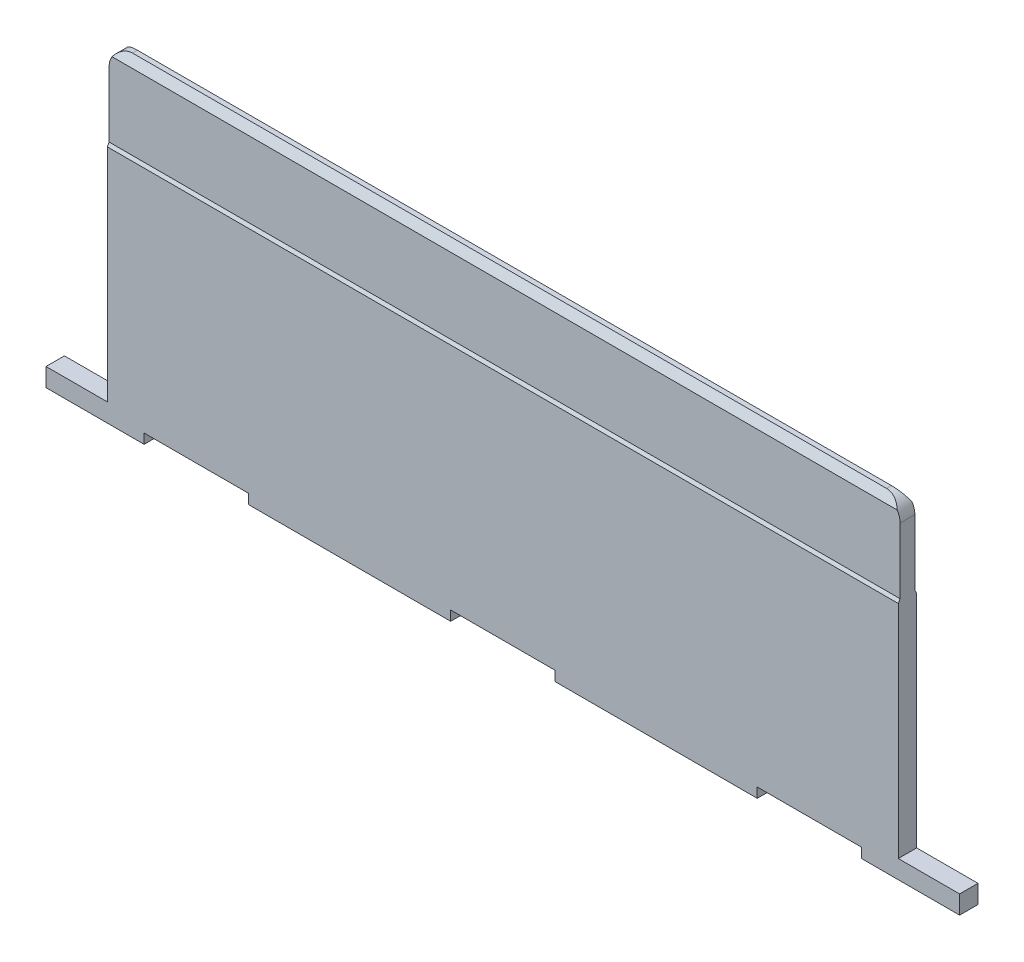
ISO-10303-21;
HEADER;
FILE_DESCRIPTION(('STEP AP214'),'2;1');
FILE_NAME('part.step','',(''),(''),'','','');
FILE_SCHEMA(('AUTOMOTIVE_DESIGN { 1 0 10303 214 1 1 1 1 }'));
ENDSEC;
DATA;
#1=APPLICATION_CONTEXT('core data for automotive mechanical design processes');
#2=APPLICATION_PROTOCOL_DEFINITION('international standard','automotive_design',2000,#1);
#3=PRODUCT_CONTEXT('',#1,'mechanical');
#4=PRODUCT('Part','Part','',(#3));
#5=PRODUCT_RELATED_PRODUCT_CATEGORY('part','',(#4));
#6=PRODUCT_DEFINITION_FORMATION('','',#4);
#7=PRODUCT_DEFINITION_CONTEXT('part definition',#1,'design');
#8=PRODUCT_DEFINITION('design','',#6,#7);
#9=PRODUCT_DEFINITION_SHAPE('','',#8);
#10=(LENGTH_UNIT() NAMED_UNIT(*) SI_UNIT(.MILLI.,.METRE.));
#11=(NAMED_UNIT(*) PLANE_ANGLE_UNIT() SI_UNIT($,.RADIAN.));
#12=(NAMED_UNIT(*) SI_UNIT($,.STERADIAN.) SOLID_ANGLE_UNIT());
#13=UNCERTAINTY_MEASURE_WITH_UNIT(LENGTH_MEASURE(1.E-05),#10,'distance_accuracy_value','');
#14=(GEOMETRIC_REPRESENTATION_CONTEXT(3) GLOBAL_UNCERTAINTY_ASSIGNED_CONTEXT((#13)) GLOBAL_UNIT_ASSIGNED_CONTEXT((#10,
#11,#12)) REPRESENTATION_CONTEXT('',''));
#15=CARTESIAN_POINT('',(0.,0.,0.));
#16=DIRECTION('',(0.,0.,1.));
#17=DIRECTION('',(1.,0.,0.));
#18=AXIS2_PLACEMENT_3D('',#15,#16,#17);
#19=CARTESIAN_POINT('',(-8.1915,0.1778,0.399999962));
#20=DIRECTION('',(0.,-1.,0.));
#21=DIRECTION('',(1.,0.,0.));
#22=AXIS2_PLACEMENT_3D('',#19,#20,#21);
#23=PLANE('',#22);
#24=DIRECTION('',(0.,0.,-1.));
#25=VECTOR('',#24,1.);
#26=CARTESIAN_POINT('',(-8.1915,0.177800000000001,0.399999962));
#27=LINE('',#26,#25);
#28=CARTESIAN_POINT('',(-8.1915,0.177800000000001,0.1905));
#29=VERTEX_POINT('',#28);
#30=CARTESIAN_POINT('',(-8.1915,0.177800000000001,-0.1905));
#31=VERTEX_POINT('',#30);
#32=EDGE_CURVE('E11',#29,#31,#27,.T.);
#33=ORIENTED_EDGE('',*,*,#32,.T.);
#34=DIRECTION('',(-1.,0.,0.));
#35=VECTOR('',#34,1.);
#36=CARTESIAN_POINT('',(-8.1915,0.1778,-0.1905));
#37=LINE('',#36,#35);
#38=CARTESIAN_POINT('',(-9.4615,0.1778,-0.1905));
#39=VERTEX_POINT('',#38);
#40=EDGE_CURVE('E24',#31,#39,#37,.T.);
#41=ORIENTED_EDGE('',*,*,#40,.T.);
#42=DIRECTION('',(0.,0.,-1.));
#43=VECTOR('',#42,1.);
#44=CARTESIAN_POINT('',(-9.4615,0.1778,0.399999962));
#45=LINE('',#44,#43);
#46=CARTESIAN_POINT('',(-9.4615,0.1778,0.1905));
#47=VERTEX_POINT('',#46);
#48=EDGE_CURVE('E418',#47,#39,#45,.T.);
#49=ORIENTED_EDGE('',*,*,#48,.F.);
#50=DIRECTION('',(1.,0.,0.));
#51=VECTOR('',#50,1.);
#52=CARTESIAN_POINT('',(-8.1915,0.1778,0.1905));
#53=LINE('',#52,#51);
#54=EDGE_CURVE('E416',#47,#29,#53,.T.);
#55=ORIENTED_EDGE('',*,*,#54,.T.);
#56=EDGE_LOOP('',(#33,#41,#49,#55));
#57=FACE_BOUND('',#56,.T.);
#58=ADVANCED_FACE('F17',(#57),#23,.F.);
#59=CARTESIAN_POINT('',(-9.4615,0.1778,0.399999962));
#60=DIRECTION('',(1.,0.,0.));
#61=DIRECTION('',(0.,0.,-1.));
#62=AXIS2_PLACEMENT_3D('',#59,#60,#61);
#63=PLANE('',#62);
#64=ORIENTED_EDGE('',*,*,#48,.T.);
#65=DIRECTION('',(0.,-1.,0.));
#66=VECTOR('',#65,1.);
#67=CARTESIAN_POINT('',(-9.4615,0.1778,-0.1905));
#68=LINE('',#67,#66);
#69=CARTESIAN_POINT('',(-9.4615,-0.2032,-0.1905));
#70=VERTEX_POINT('',#69);
#71=EDGE_CURVE('E414',#39,#70,#68,.T.);
#72=ORIENTED_EDGE('',*,*,#71,.T.);
#73=DIRECTION('',(0.,0.,-1.));
#74=VECTOR('',#73,1.);
#75=CARTESIAN_POINT('',(-9.4615,-0.2032,0.399999962));
#76=LINE('',#75,#74);
#77=CARTESIAN_POINT('',(-9.4615,-0.2032,0.1905));
#78=VERTEX_POINT('',#77);
#79=EDGE_CURVE('E411',#78,#70,#76,.T.);
#80=ORIENTED_EDGE('',*,*,#79,.F.);
#81=DIRECTION('',(0.,1.,0.));
#82=VECTOR('',#81,1.);
#83=CARTESIAN_POINT('',(-9.4615,0.1778,0.1905));
#84=LINE('',#83,#82);
#85=EDGE_CURVE('E408',#78,#47,#84,.T.);
#86=ORIENTED_EDGE('',*,*,#85,.T.);
#87=EDGE_LOOP('',(#64,#72,#80,#86));
#88=FACE_BOUND('',#87,.T.);
#89=ADVANCED_FACE('F425',(#88),#63,.F.);
#90=CARTESIAN_POINT('',(-9.4615,-0.2032,0.399999962));
#91=DIRECTION('',(0.,1.,0.));
#92=DIRECTION('',(0.,0.,1.));
#93=AXIS2_PLACEMENT_3D('',#90,#91,#92);
#94=PLANE('',#93);
#95=ORIENTED_EDGE('',*,*,#79,.T.);
#96=DIRECTION('',(-1.,0.,0.));
#97=VECTOR('',#96,1.);
#98=CARTESIAN_POINT('',(10.00000032,-0.2032,-0.1905));
#99=LINE('',#98,#97);
#100=CARTESIAN_POINT('',(-7.429000128,-0.2032,-0.1905));
#101=VERTEX_POINT('',#100);
#102=EDGE_CURVE('E405',#101,#70,#99,.T.);
#103=ORIENTED_EDGE('',*,*,#102,.F.);
#104=DIRECTION('',(0.,0.,-1.));
#105=VECTOR('',#104,1.);
#106=CARTESIAN_POINT('',(-7.429000128,-0.2032,0.399999962));
#107=LINE('',#106,#105);
#108=CARTESIAN_POINT('',(-7.429000128,-0.2032,0.1905));
#109=VERTEX_POINT('',#108);
#110=EDGE_CURVE('E402',#109,#101,#107,.T.);
#111=ORIENTED_EDGE('',*,*,#110,.F.);
#112=DIRECTION('',(-1.,0.,0.));
#113=VECTOR('',#112,1.);
#114=CARTESIAN_POINT('',(10.00000032,-0.2032,0.1905));
#115=LINE('',#114,#113);
#116=EDGE_CURVE('E399',#109,#78,#115,.T.);
#117=ORIENTED_EDGE('',*,*,#116,.T.);
#118=EDGE_LOOP('',(#95,#103,#111,#117));
#119=FACE_BOUND('',#118,.T.);
#120=ADVANCED_FACE('F431',(#119),#94,.F.);
#121=CARTESIAN_POINT('',(-7.429000128,-0.2032,0.399999962));
#122=DIRECTION('',(-1.,0.,0.));
#123=DIRECTION('',(0.,0.,1.));
#124=AXIS2_PLACEMENT_3D('',#121,#122,#123);
#125=PLANE('',#124);
#126=ORIENTED_EDGE('',*,*,#110,.T.);
#127=DIRECTION('',(0.,1.,0.));
#128=VECTOR('',#127,1.);
#129=CARTESIAN_POINT('',(-7.429000128,-0.2032,-0.1905));
#130=LINE('',#129,#128);
#131=CARTESIAN_POINT('',(-7.429000128,0.,-0.1905));
#132=VERTEX_POINT('',#131);
#133=EDGE_CURVE('E397',#101,#132,#130,.T.);
#134=ORIENTED_EDGE('',*,*,#133,.T.);
#135=DIRECTION('',(0.,0.,-1.));
#136=VECTOR('',#135,1.);
#137=CARTESIAN_POINT('',(-7.429000128,0.,0.399999962));
#138=LINE('',#137,#136);
#139=CARTESIAN_POINT('',(-7.429000128,0.,0.1905));
#140=VERTEX_POINT('',#139);
#141=EDGE_CURVE('E394',#140,#132,#138,.T.);
#142=ORIENTED_EDGE('',*,*,#141,.F.);
#143=DIRECTION('',(0.,-1.,0.));
#144=VECTOR('',#143,1.);
#145=CARTESIAN_POINT('',(-7.429000128,-0.2032,0.1905));
#146=LINE('',#145,#144);
#147=EDGE_CURVE('E391',#140,#109,#146,.T.);
#148=ORIENTED_EDGE('',*,*,#147,.T.);
#149=EDGE_LOOP('',(#126,#134,#142,#148));
#150=FACE_BOUND('',#149,.T.);
#151=ADVANCED_FACE('F434',(#150),#125,.F.);
#152=CARTESIAN_POINT('',(-7.429000128,0.,0.399999962));
#153=DIRECTION('',(0.,1.,0.));
#154=DIRECTION('',(0.,0.,1.));
#155=AXIS2_PLACEMENT_3D('',#152,#153,#154);
#156=PLANE('',#155);
#157=ORIENTED_EDGE('',*,*,#141,.T.);
#158=DIRECTION('',(1.,0.,0.));
#159=VECTOR('',#158,1.);
#160=CARTESIAN_POINT('',(-7.429000128,0.,-0.1905));
#161=LINE('',#160,#159);
#162=CARTESIAN_POINT('',(-5.271000126,0.,-0.1905));
#163=VERTEX_POINT('',#162);
#164=EDGE_CURVE('E389',#132,#163,#161,.T.);
#165=ORIENTED_EDGE('',*,*,#164,.T.);
#166=DIRECTION('',(0.,0.,-1.));
#167=VECTOR('',#166,1.);
#168=CARTESIAN_POINT('',(-5.271000126,0.,0.399999962));
#169=LINE('',#168,#167);
#170=CARTESIAN_POINT('',(-5.271000126,0.,0.1905));
#171=VERTEX_POINT('',#170);
#172=EDGE_CURVE('E386',#171,#163,#169,.T.);
#173=ORIENTED_EDGE('',*,*,#172,.F.);
#174=DIRECTION('',(-1.,0.,0.));
#175=VECTOR('',#174,1.);
#176=CARTESIAN_POINT('',(-7.429000128,0.,0.1905));
#177=LINE('',#176,#175);
#178=EDGE_CURVE('E383',#171,#140,#177,.T.);
#179=ORIENTED_EDGE('',*,*,#178,.T.);
#180=EDGE_LOOP('',(#157,#165,#173,#179));
#181=FACE_BOUND('',#180,.T.);
#182=ADVANCED_FACE('F441',(#181),#156,.F.);
#183=CARTESIAN_POINT('',(-5.271000126,0.,0.399999962));
#184=DIRECTION('',(1.,0.,0.));
#185=DIRECTION('',(0.,0.,-1.));
#186=AXIS2_PLACEMENT_3D('',#183,#184,#185);
#187=PLANE('',#186);
#188=ORIENTED_EDGE('',*,*,#172,.T.);
#189=DIRECTION('',(0.,-1.,0.));
#190=VECTOR('',#189,1.);
#191=CARTESIAN_POINT('',(-5.271000126,0.,-0.1905));
#192=LINE('',#191,#190);
#193=CARTESIAN_POINT('',(-5.271000126,-0.203000102,-0.1905));
#194=VERTEX_POINT('',#193);
#195=EDGE_CURVE('E381',#163,#194,#192,.T.);
#196=ORIENTED_EDGE('',*,*,#195,.T.);
#197=DIRECTION('',(0.,0.,-1.));
#198=VECTOR('',#197,1.);
#199=CARTESIAN_POINT('',(-5.271000126,-0.203000102,0.399999962));
#200=LINE('',#199,#198);
#201=CARTESIAN_POINT('',(-5.271000126,-0.203000102,0.1905));
#202=VERTEX_POINT('',#201);
#203=EDGE_CURVE('E378',#202,#194,#200,.T.);
#204=ORIENTED_EDGE('',*,*,#203,.F.);
#205=DIRECTION('',(0.,1.,0.));
#206=VECTOR('',#205,1.);
#207=CARTESIAN_POINT('',(-5.271000126,0.,0.1905));
#208=LINE('',#207,#206);
#209=EDGE_CURVE('E375',#202,#171,#208,.T.);
#210=ORIENTED_EDGE('',*,*,#209,.T.);
#211=EDGE_LOOP('',(#188,#196,#204,#210));
#212=FACE_BOUND('',#211,.T.);
#213=ADVANCED_FACE('F444',(#212),#187,.F.);
#214=CARTESIAN_POINT('',(-5.271000126,-0.203000102,0.399999962));
#215=DIRECTION('',(0.,1.,0.));
#216=DIRECTION('',(0.,0.,1.));
#217=AXIS2_PLACEMENT_3D('',#214,#215,#216);
#218=PLANE('',#217);
#219=ORIENTED_EDGE('',*,*,#203,.T.);
#220=DIRECTION('',(1.,0.,0.));
#221=VECTOR('',#220,1.);
#222=CARTESIAN_POINT('',(-5.271000126,-0.203000102,-0.1905));
#223=LINE('',#222,#221);
#224=CARTESIAN_POINT('',(-1.080000126,-0.203000102,-0.1905));
#225=VERTEX_POINT('',#224);
#226=EDGE_CURVE('E373',#194,#225,#223,.T.);
#227=ORIENTED_EDGE('',*,*,#226,.T.);
#228=DIRECTION('',(0.,0.,-1.));
#229=VECTOR('',#228,1.);
#230=CARTESIAN_POINT('',(-1.080000126,-0.203000102,0.399999962));
#231=LINE('',#230,#229);
#232=CARTESIAN_POINT('',(-1.080000126,-0.203000102,0.1905));
#233=VERTEX_POINT('',#232);
#234=EDGE_CURVE('E370',#233,#225,#231,.T.);
#235=ORIENTED_EDGE('',*,*,#234,.F.);
#236=DIRECTION('',(-1.,0.,0.));
#237=VECTOR('',#236,1.);
#238=CARTESIAN_POINT('',(-5.271000126,-0.203000102,0.1905));
#239=LINE('',#238,#237);
#240=EDGE_CURVE('E367',#233,#202,#239,.T.);
#241=ORIENTED_EDGE('',*,*,#240,.T.);
#242=EDGE_LOOP('',(#219,#227,#235,#241));
#243=FACE_BOUND('',#242,.T.);
#244=ADVANCED_FACE('F449',(#243),#218,.F.);
#245=CARTESIAN_POINT('',(-1.080000126,-0.203000102,0.399999962));
#246=DIRECTION('',(-1.,0.,0.));
#247=DIRECTION('',(0.,0.,1.));
#248=AXIS2_PLACEMENT_3D('',#245,#246,#247);
#249=PLANE('',#248);
#250=ORIENTED_EDGE('',*,*,#234,.T.);
#251=DIRECTION('',(0.,1.,0.));
#252=VECTOR('',#251,1.);
#253=CARTESIAN_POINT('',(-1.080000126,-0.203000102,-0.1905));
#254=LINE('',#253,#252);
#255=CARTESIAN_POINT('',(-1.080000126,0.,-0.1905));
#256=VERTEX_POINT('',#255);
#257=EDGE_CURVE('E365',#225,#256,#254,.T.);
#258=ORIENTED_EDGE('',*,*,#257,.T.);
#259=DIRECTION('',(0.,0.,-1.));
#260=VECTOR('',#259,1.);
#261=CARTESIAN_POINT('',(-1.080000126,0.,0.399999962));
#262=LINE('',#261,#260);
#263=CARTESIAN_POINT('',(-1.080000126,0.,0.1905));
#264=VERTEX_POINT('',#263);
#265=EDGE_CURVE('E362',#264,#256,#262,.T.);
#266=ORIENTED_EDGE('',*,*,#265,.F.);
#267=DIRECTION('',(0.,-1.,0.));
#268=VECTOR('',#267,1.);
#269=CARTESIAN_POINT('',(-1.080000126,-0.203000102,0.1905));
#270=LINE('',#269,#268);
#271=EDGE_CURVE('E359',#264,#233,#270,.T.);
#272=ORIENTED_EDGE('',*,*,#271,.T.);
#273=EDGE_LOOP('',(#250,#258,#266,#272));
#274=FACE_BOUND('',#273,.T.);
#275=ADVANCED_FACE('F452',(#274),#249,.F.);
#276=CARTESIAN_POINT('',(-1.080000126,0.,0.399999962));
#277=DIRECTION('',(0.,1.,0.));
#278=DIRECTION('',(0.,0.,1.));
#279=AXIS2_PLACEMENT_3D('',#276,#277,#278);
#280=PLANE('',#279);
#281=ORIENTED_EDGE('',*,*,#265,.T.);
#282=DIRECTION('',(1.,0.,0.));
#283=VECTOR('',#282,1.);
#284=CARTESIAN_POINT('',(-1.080000126,0.,-0.1905));
#285=LINE('',#284,#283);
#286=CARTESIAN_POINT('',(1.080000126,0.,-0.1905));
#287=VERTEX_POINT('',#286);
#288=EDGE_CURVE('E357',#256,#287,#285,.T.);
#289=ORIENTED_EDGE('',*,*,#288,.T.);
#290=DIRECTION('',(0.,0.,-1.));
#291=VECTOR('',#290,1.);
#292=CARTESIAN_POINT('',(1.080000126,0.,0.399999962));
#293=LINE('',#292,#291);
#294=CARTESIAN_POINT('',(1.080000126,0.,0.1905));
#295=VERTEX_POINT('',#294);
#296=EDGE_CURVE('E354',#295,#287,#293,.T.);
#297=ORIENTED_EDGE('',*,*,#296,.F.);
#298=DIRECTION('',(-1.,0.,0.));
#299=VECTOR('',#298,1.);
#300=CARTESIAN_POINT('',(-1.080000126,0.,0.1905));
#301=LINE('',#300,#299);
#302=EDGE_CURVE('E351',#295,#264,#301,.T.);
#303=ORIENTED_EDGE('',*,*,#302,.T.);
#304=EDGE_LOOP('',(#281,#289,#297,#303));
#305=FACE_BOUND('',#304,.T.);
#306=ADVANCED_FACE('F457',(#305),#280,.F.);
#307=CARTESIAN_POINT('',(1.080000126,0.,0.399999962));
#308=DIRECTION('',(1.,0.,0.));
#309=DIRECTION('',(0.,0.,-1.));
#310=AXIS2_PLACEMENT_3D('',#307,#308,#309);
#311=PLANE('',#310);
#312=ORIENTED_EDGE('',*,*,#296,.T.);
#313=DIRECTION('',(0.,-1.,0.));
#314=VECTOR('',#313,1.);
#315=CARTESIAN_POINT('',(1.080000126,0.,-0.1905));
#316=LINE('',#315,#314);
#317=CARTESIAN_POINT('',(1.080000126,-0.2032,-0.1905));
#318=VERTEX_POINT('',#317);
#319=EDGE_CURVE('E349',#287,#318,#316,.T.);
#320=ORIENTED_EDGE('',*,*,#319,.T.);
#321=DIRECTION('',(0.,0.,-1.));
#322=VECTOR('',#321,1.);
#323=CARTESIAN_POINT('',(1.080000126,-0.2032,0.399999962));
#324=LINE('',#323,#322);
#325=CARTESIAN_POINT('',(1.080000126,-0.2032,0.1905));
#326=VERTEX_POINT('',#325);
#327=EDGE_CURVE('E346',#326,#318,#324,.T.);
#328=ORIENTED_EDGE('',*,*,#327,.F.);
#329=DIRECTION('',(0.,1.,0.));
#330=VECTOR('',#329,1.);
#331=CARTESIAN_POINT('',(1.080000126,0.,0.1905));
#332=LINE('',#331,#330);
#333=EDGE_CURVE('E343',#326,#295,#332,.T.);
#334=ORIENTED_EDGE('',*,*,#333,.T.);
#335=EDGE_LOOP('',(#312,#320,#328,#334));
#336=FACE_BOUND('',#335,.T.);
#337=ADVANCED_FACE('F460',(#336),#311,.F.);
#338=CARTESIAN_POINT('',(1.080000126,-0.2032,0.399999962));
#339=DIRECTION('',(0.,1.,0.));
#340=DIRECTION('',(0.,0.,1.));
#341=AXIS2_PLACEMENT_3D('',#338,#339,#340);
#342=PLANE('',#341);
#343=ORIENTED_EDGE('',*,*,#327,.T.);
#344=DIRECTION('',(-1.,0.,0.));
#345=VECTOR('',#344,1.);
#346=CARTESIAN_POINT('',(10.00000032,-0.2032,-0.1905));
#347=LINE('',#346,#345);
#348=CARTESIAN_POINT('',(5.270000128,-0.2032,-0.1905));
#349=VERTEX_POINT('',#348);
#350=EDGE_CURVE('E340',#349,#318,#347,.T.);
#351=ORIENTED_EDGE('',*,*,#350,.F.);
#352=DIRECTION('',(0.,0.,-1.));
#353=VECTOR('',#352,1.);
#354=CARTESIAN_POINT('',(5.270000128,-0.2032,0.399999962));
#355=LINE('',#354,#353);
#356=CARTESIAN_POINT('',(5.270000128,-0.2032,0.1905));
#357=VERTEX_POINT('',#356);
#358=EDGE_CURVE('E337',#357,#349,#355,.T.);
#359=ORIENTED_EDGE('',*,*,#358,.F.);
#360=DIRECTION('',(-1.,0.,0.));
#361=VECTOR('',#360,1.);
#362=CARTESIAN_POINT('',(10.00000032,-0.2032,0.1905));
#363=LINE('',#362,#361);
#364=EDGE_CURVE('E334',#357,#326,#363,.T.);
#365=ORIENTED_EDGE('',*,*,#364,.T.);
#366=EDGE_LOOP('',(#343,#351,#359,#365));
#367=FACE_BOUND('',#366,.T.);
#368=ADVANCED_FACE('F464',(#367),#342,.F.);
#369=CARTESIAN_POINT('',(5.270000128,-0.2032,0.399999962));
#370=DIRECTION('',(-1.,0.,0.));
#371=DIRECTION('',(0.,0.,1.));
#372=AXIS2_PLACEMENT_3D('',#369,#370,#371);
#373=PLANE('',#372);
#374=ORIENTED_EDGE('',*,*,#358,.T.);
#375=DIRECTION('',(0.,1.,0.));
#376=VECTOR('',#375,1.);
#377=CARTESIAN_POINT('',(5.270000128,-0.2032,-0.1905));
#378=LINE('',#377,#376);
#379=CARTESIAN_POINT('',(5.270000128,0.,-0.1905));
#380=VERTEX_POINT('',#379);
#381=EDGE_CURVE('E332',#349,#380,#378,.T.);
#382=ORIENTED_EDGE('',*,*,#381,.T.);
#383=DIRECTION('',(0.,0.,-1.));
#384=VECTOR('',#383,1.);
#385=CARTESIAN_POINT('',(5.270000128,0.,0.399999962));
#386=LINE('',#385,#384);
#387=CARTESIAN_POINT('',(5.270000128,0.,0.1905));
#388=VERTEX_POINT('',#387);
#389=EDGE_CURVE('E329',#388,#380,#386,.T.);
#390=ORIENTED_EDGE('',*,*,#389,.F.);
#391=DIRECTION('',(0.,-1.,0.));
#392=VECTOR('',#391,1.);
#393=CARTESIAN_POINT('',(5.270000128,-0.2032,0.1905));
#394=LINE('',#393,#392);
#395=EDGE_CURVE('E326',#388,#357,#394,.T.);
#396=ORIENTED_EDGE('',*,*,#395,.T.);
#397=EDGE_LOOP('',(#374,#382,#390,#396));
#398=FACE_BOUND('',#397,.T.);
#399=ADVANCED_FACE('F467',(#398),#373,.F.);
#400=CARTESIAN_POINT('',(5.270000128,0.,0.399999962));
#401=DIRECTION('',(0.,1.,0.));
#402=DIRECTION('',(0.,0.,1.));
#403=AXIS2_PLACEMENT_3D('',#400,#401,#402);
#404=PLANE('',#403);
#405=ORIENTED_EDGE('',*,*,#389,.T.);
#406=DIRECTION('',(1.,0.,0.));
#407=VECTOR('',#406,1.);
#408=CARTESIAN_POINT('',(5.270000128,0.,-0.1905));
#409=LINE('',#408,#407);
#410=CARTESIAN_POINT('',(7.429000128,0.,-0.1905));
#411=VERTEX_POINT('',#410);
#412=EDGE_CURVE('E324',#380,#411,#409,.T.);
#413=ORIENTED_EDGE('',*,*,#412,.T.);
#414=DIRECTION('',(0.,0.,-1.));
#415=VECTOR('',#414,1.);
#416=CARTESIAN_POINT('',(7.429000128,0.,0.399999962));
#417=LINE('',#416,#415);
#418=CARTESIAN_POINT('',(7.429000128,0.,0.1905));
#419=VERTEX_POINT('',#418);
#420=EDGE_CURVE('E321',#419,#411,#417,.T.);
#421=ORIENTED_EDGE('',*,*,#420,.F.);
#422=DIRECTION('',(-1.,0.,0.));
#423=VECTOR('',#422,1.);
#424=CARTESIAN_POINT('',(5.270000128,0.,0.1905));
#425=LINE('',#424,#423);
#426=EDGE_CURVE('E318',#419,#388,#425,.T.);
#427=ORIENTED_EDGE('',*,*,#426,.T.);
#428=EDGE_LOOP('',(#405,#413,#421,#427));
#429=FACE_BOUND('',#428,.T.);
#430=ADVANCED_FACE('F472',(#429),#404,.F.);
#431=CARTESIAN_POINT('',(7.429000128,0.,0.399999962));
#432=DIRECTION('',(1.,0.,0.));
#433=DIRECTION('',(0.,0.,-1.));
#434=AXIS2_PLACEMENT_3D('',#431,#432,#433);
#435=PLANE('',#434);
#436=ORIENTED_EDGE('',*,*,#420,.T.);
#437=DIRECTION('',(0.,-1.,0.));
#438=VECTOR('',#437,1.);
#439=CARTESIAN_POINT('',(7.429000128,0.,-0.1905));
#440=LINE('',#439,#438);
#441=CARTESIAN_POINT('',(7.429000128,-0.2032,-0.1905));
#442=VERTEX_POINT('',#441);
#443=EDGE_CURVE('E316',#411,#442,#440,.T.);
#444=ORIENTED_EDGE('',*,*,#443,.T.);
#445=DIRECTION('',(0.,0.,-1.));
#446=VECTOR('',#445,1.);
#447=CARTESIAN_POINT('',(7.429000128,-0.2032,0.399999962));
#448=LINE('',#447,#446);
#449=CARTESIAN_POINT('',(7.429000128,-0.2032,0.1905));
#450=VERTEX_POINT('',#449);
#451=EDGE_CURVE('E313',#450,#442,#448,.T.);
#452=ORIENTED_EDGE('',*,*,#451,.F.);
#453=DIRECTION('',(0.,1.,0.));
#454=VECTOR('',#453,1.);
#455=CARTESIAN_POINT('',(7.429000128,0.,0.1905));
#456=LINE('',#455,#454);
#457=EDGE_CURVE('E310',#450,#419,#456,.T.);
#458=ORIENTED_EDGE('',*,*,#457,.T.);
#459=EDGE_LOOP('',(#436,#444,#452,#458));
#460=FACE_BOUND('',#459,.T.);
#461=ADVANCED_FACE('F475',(#460),#435,.F.);
#462=CARTESIAN_POINT('',(7.429000128,-0.2032,0.399999962));
#463=DIRECTION('',(0.,1.,0.));
#464=DIRECTION('',(0.,0.,1.));
#465=AXIS2_PLACEMENT_3D('',#462,#463,#464);
#466=PLANE('',#465);
#467=ORIENTED_EDGE('',*,*,#451,.T.);
#468=DIRECTION('',(-1.,0.,0.));
#469=VECTOR('',#468,1.);
#470=CARTESIAN_POINT('',(10.00000032,-0.2032,-0.1905));
#471=LINE('',#470,#469);
#472=CARTESIAN_POINT('',(9.4615,-0.2032,-0.1905));
#473=VERTEX_POINT('',#472);
#474=EDGE_CURVE('E307',#473,#442,#471,.T.);
#475=ORIENTED_EDGE('',*,*,#474,.F.);
#476=DIRECTION('',(0.,0.,-1.));
#477=VECTOR('',#476,1.);
#478=CARTESIAN_POINT('',(9.4615,-0.2032,0.399999962));
#479=LINE('',#478,#477);
#480=CARTESIAN_POINT('',(9.4615,-0.2032,0.1905));
#481=VERTEX_POINT('',#480);
#482=EDGE_CURVE('E304',#481,#473,#479,.T.);
#483=ORIENTED_EDGE('',*,*,#482,.F.);
#484=DIRECTION('',(-1.,0.,0.));
#485=VECTOR('',#484,1.);
#486=CARTESIAN_POINT('',(10.00000032,-0.2032,0.1905));
#487=LINE('',#486,#485);
#488=EDGE_CURVE('E301',#481,#450,#487,.T.);
#489=ORIENTED_EDGE('',*,*,#488,.T.);
#490=EDGE_LOOP('',(#467,#475,#483,#489));
#491=FACE_BOUND('',#490,.T.);
#492=ADVANCED_FACE('F479',(#491),#466,.F.);
#493=CARTESIAN_POINT('',(9.4615,-0.2032,0.399999962));
#494=DIRECTION('',(-1.,0.,0.));
#495=DIRECTION('',(0.,0.,1.));
#496=AXIS2_PLACEMENT_3D('',#493,#494,#495);
#497=PLANE('',#496);
#498=ORIENTED_EDGE('',*,*,#482,.T.);
#499=DIRECTION('',(0.,1.,0.));
#500=VECTOR('',#499,1.);
#501=CARTESIAN_POINT('',(9.4615,-0.2032,-0.1905));
#502=LINE('',#501,#500);
#503=CARTESIAN_POINT('',(9.4615,0.1778,-0.1905));
#504=VERTEX_POINT('',#503);
#505=EDGE_CURVE('E299',#473,#504,#502,.T.);
#506=ORIENTED_EDGE('',*,*,#505,.T.);
#507=DIRECTION('',(0.,0.,-1.));
#508=VECTOR('',#507,1.);
#509=CARTESIAN_POINT('',(9.4615,0.1778,0.399999962));
#510=LINE('',#509,#508);
#511=CARTESIAN_POINT('',(9.4615,0.1778,0.1905));
#512=VERTEX_POINT('',#511);
#513=EDGE_CURVE('E296',#512,#504,#510,.T.);
#514=ORIENTED_EDGE('',*,*,#513,.F.);
#515=DIRECTION('',(0.,-1.,0.));
#516=VECTOR('',#515,1.);
#517=CARTESIAN_POINT('',(9.4615,-0.2032,0.1905));
#518=LINE('',#517,#516);
#519=EDGE_CURVE('E293',#512,#481,#518,.T.);
#520=ORIENTED_EDGE('',*,*,#519,.T.);
#521=EDGE_LOOP('',(#498,#506,#514,#520));
#522=FACE_BOUND('',#521,.T.);
#523=ADVANCED_FACE('F482',(#522),#497,.F.);
#524=CARTESIAN_POINT('',(9.4615,0.1778,0.399999962));
#525=DIRECTION('',(0.,-1.,0.));
#526=DIRECTION('',(1.,0.,0.));
#527=AXIS2_PLACEMENT_3D('',#524,#525,#526);
#528=PLANE('',#527);
#529=ORIENTED_EDGE('',*,*,#513,.T.);
#530=DIRECTION('',(-1.,0.,0.));
#531=VECTOR('',#530,1.);
#532=CARTESIAN_POINT('',(9.4615,0.1778,-0.1905));
#533=LINE('',#532,#531);
#534=CARTESIAN_POINT('',(8.1915,0.1778,-0.1905));
#535=VERTEX_POINT('',#534);
#536=EDGE_CURVE('E291',#504,#535,#533,.T.);
#537=ORIENTED_EDGE('',*,*,#536,.T.);
#538=DIRECTION('',(0.,0.,-1.));
#539=VECTOR('',#538,1.);
#540=CARTESIAN_POINT('',(8.1915,0.1778,0.399999962));
#541=LINE('',#540,#539);
#542=CARTESIAN_POINT('',(8.1915,0.1778,0.1905));
#543=VERTEX_POINT('',#542);
#544=EDGE_CURVE('E288',#543,#535,#541,.T.);
#545=ORIENTED_EDGE('',*,*,#544,.F.);
#546=DIRECTION('',(1.,0.,0.));
#547=VECTOR('',#546,1.);
#548=CARTESIAN_POINT('',(9.4615,0.1778,0.1905));
#549=LINE('',#548,#547);
#550=EDGE_CURVE('E285',#543,#512,#549,.T.);
#551=ORIENTED_EDGE('',*,*,#550,.T.);
#552=EDGE_LOOP('',(#529,#537,#545,#551));
#553=FACE_BOUND('',#552,.T.);
#554=ADVANCED_FACE('F487',(#553),#528,.F.);
#555=CARTESIAN_POINT('',(8.1915,0.1778,0.399999962));
#556=DIRECTION('',(-1.,0.,0.));
#557=DIRECTION('',(0.,0.,1.));
#558=AXIS2_PLACEMENT_3D('',#555,#556,#557);
#559=PLANE('',#558);
#560=DIRECTION('',(0.,0.866025403784439,0.499999999999999));
#561=VECTOR('',#560,1.);
#562=CARTESIAN_POINT('',(8.1915,1.5771289840129,-2.023708934814));
#563=LINE('',#562,#561);
#564=CARTESIAN_POINT('',(8.1915,4.75234,-0.1905));
#565=VERTEX_POINT('',#564);
#566=CARTESIAN_POINT('',(8.1915,4.8183311357684,-0.1524));
#567=VERTEX_POINT('',#566);
#568=EDGE_CURVE('E283',#565,#567,#563,.T.);
#569=ORIENTED_EDGE('',*,*,#568,.T.);
#570=DIRECTION('',(0.,1.,0.));
#571=VECTOR('',#570,1.);
#572=CARTESIAN_POINT('',(8.1915,0.1778,-0.1524));
#573=LINE('',#572,#571);
#574=CARTESIAN_POINT('',(8.1915,6.17474,-0.1524));
#575=VERTEX_POINT('',#574);
#576=EDGE_CURVE('E281',#567,#575,#573,.T.);
#577=ORIENTED_EDGE('',*,*,#576,.T.);
#578=DIRECTION('',(0.,0.,-1.));
#579=VECTOR('',#578,1.);
#580=CARTESIAN_POINT('',(8.1915,6.17474,0.399999962));
#581=LINE('',#580,#579);
#582=CARTESIAN_POINT('',(8.1915,6.17474,0.1524));
#583=VERTEX_POINT('',#582);
#584=EDGE_CURVE('E278',#583,#575,#581,.T.);
#585=ORIENTED_EDGE('',*,*,#584,.F.);
#586=DIRECTION('',(0.,-1.,0.));
#587=VECTOR('',#586,1.);
#588=CARTESIAN_POINT('',(8.1915,0.1778,0.1524));
#589=LINE('',#588,#587);
#590=CARTESIAN_POINT('',(8.1915,4.8183311357684,0.1524));
#591=VERTEX_POINT('',#590);
#592=EDGE_CURVE('E276',#583,#591,#589,.T.);
#593=ORIENTED_EDGE('',*,*,#592,.T.);
#594=DIRECTION('',(0.,-0.866025403784439,0.499999999999999));
#595=VECTOR('',#594,1.);
#596=CARTESIAN_POINT('',(8.1915,1.2307188554081,2.223708915814));
#597=LINE('',#596,#595);
#598=CARTESIAN_POINT('',(8.1915,4.75234,0.1905));
#599=VERTEX_POINT('',#598);
#600=EDGE_CURVE('E220',#591,#599,#597,.T.);
#601=ORIENTED_EDGE('',*,*,#600,.T.);
#602=DIRECTION('',(0.,-1.,0.));
#603=VECTOR('',#602,1.);
#604=CARTESIAN_POINT('',(8.1915,0.1778,0.1905));
#605=LINE('',#604,#603);
#606=EDGE_CURVE('E272',#599,#543,#605,.T.);
#607=ORIENTED_EDGE('',*,*,#606,.T.);
#608=ORIENTED_EDGE('',*,*,#544,.T.);
#609=DIRECTION('',(0.,1.,0.));
#610=VECTOR('',#609,1.);
#611=CARTESIAN_POINT('',(8.1915,0.1778,-0.1905));
#612=LINE('',#611,#610);
#613=EDGE_CURVE('E269',#535,#565,#612,.T.);
#614=ORIENTED_EDGE('',*,*,#613,.T.);
#615=EDGE_LOOP('',(#569,#577,#585,#593,#601,#607,#608,#614));
#616=FACE_BOUND('',#615,.T.);
#617=ADVANCED_FACE('F490',(#616),#559,.F.);
#618=CARTESIAN_POINT('',(7.8105,6.17474,0.399999962));
#619=DIRECTION('',(0.,0.,-1.));
#620=DIRECTION('',(-1.,0.,0.));
#621=AXIS2_PLACEMENT_3D('',#618,#619,#620);
#622=CYLINDRICAL_SURFACE('',#621,0.381);
#623=CARTESIAN_POINT('',(7.8105,6.17474,0.270770452561248));
#624=DIRECTION('',(0.,-0.5,-0.866025403784439));
#625=DIRECTION('',(0.,0.866025403784439,-0.5));
#626=AXIS2_PLACEMENT_3D('',#623,#624,#625);
#627=ELLIPSE('',#626,0.439940905122496,0.381);
#628=CARTESIAN_POINT('',(7.8105,6.55574,0.0508));
#629=VERTEX_POINT('',#628);
#630=CARTESIAN_POINT('',(8.1316328508286,6.379763637951,0.1524));
#631=VERTEX_POINT('',#630);
#632=EDGE_CURVE('E267',#629,#631,#627,.T.);
#633=ORIENTED_EDGE('',*,*,#632,.T.);
#634=CARTESIAN_POINT('',(7.8105,6.17474,0.1524));
#635=DIRECTION('',(0.,0.,-1.));
#636=DIRECTION('',(-1.,0.,0.));
#637=AXIS2_PLACEMENT_3D('',#634,#635,#636);
#638=CIRCLE('',#637,0.381);
#639=EDGE_CURVE('E264',#631,#583,#638,.T.);
#640=ORIENTED_EDGE('',*,*,#639,.T.);
#641=ORIENTED_EDGE('',*,*,#584,.T.);
#642=CARTESIAN_POINT('',(7.8105,6.17474,-0.1524));
#643=DIRECTION('',(0.,0.,1.));
#644=DIRECTION('',(1.,0.,0.));
#645=AXIS2_PLACEMENT_3D('',#642,#643,#644);
#646=CIRCLE('',#645,0.381);
#647=CARTESIAN_POINT('',(8.1316328508286,6.379763637951,-0.1524));
#648=VERTEX_POINT('',#647);
#649=EDGE_CURVE('E262',#575,#648,#646,.T.);
#650=ORIENTED_EDGE('',*,*,#649,.T.);
#651=CARTESIAN_POINT('',(7.8105,6.17474,-0.270770452561248));
#652=DIRECTION('',(0.,-0.5,0.866025403784439));
#653=DIRECTION('',(0.,-0.866025403784439,-0.5));
#654=AXIS2_PLACEMENT_3D('',#651,#652,#653);
#655=ELLIPSE('',#654,0.439940905122496,0.381);
#656=CARTESIAN_POINT('',(7.8105,6.55574,-0.0508));
#657=VERTEX_POINT('',#656);
#658=EDGE_CURVE('E260',#648,#657,#655,.T.);
#659=ORIENTED_EDGE('',*,*,#658,.T.);
#660=DIRECTION('',(0.,0.,-1.));
#661=VECTOR('',#660,1.);
#662=CARTESIAN_POINT('',(7.8105,6.55574,0.399999962));
#663=LINE('',#662,#661);
#664=EDGE_CURVE('E257',#629,#657,#663,.T.);
#665=ORIENTED_EDGE('',*,*,#664,.F.);
#666=EDGE_LOOP('',(#633,#640,#641,#650,#659,#665));
#667=FACE_BOUND('',#666,.T.);
#668=ADVANCED_FACE('F516',(#667),#622,.T.);
#669=CARTESIAN_POINT('',(7.8105,6.55574,0.399999962));
#670=DIRECTION('',(0.,-1.,0.));
#671=DIRECTION('',(0.,0.,-1.));
#672=AXIS2_PLACEMENT_3D('',#669,#670,#671);
#673=PLANE('',#672);
#674=DIRECTION('',(0.,0.,-1.));
#675=VECTOR('',#674,1.);
#676=CARTESIAN_POINT('',(-7.8105,6.55574,0.399999962));
#677=LINE('',#676,#675);
#678=CARTESIAN_POINT('',(-7.8105,6.55574,0.0508));
#679=VERTEX_POINT('',#678);
#680=CARTESIAN_POINT('',(-7.8105,6.55574,-0.0508));
#681=VERTEX_POINT('',#680);
#682=EDGE_CURVE('E255',#679,#681,#677,.T.);
#683=ORIENTED_EDGE('',*,*,#682,.F.);
#684=DIRECTION('',(-1.,0.,0.));
#685=VECTOR('',#684,1.);
#686=CARTESIAN_POINT('',(10.00000032,6.55574,0.0508));
#687=LINE('',#686,#685);
#688=EDGE_CURVE('E252',#629,#679,#687,.T.);
#689=ORIENTED_EDGE('',*,*,#688,.F.);
#690=ORIENTED_EDGE('',*,*,#664,.T.);
#691=DIRECTION('',(-1.,0.,0.));
#692=VECTOR('',#691,1.);
#693=CARTESIAN_POINT('',(10.00000032,6.55574,-0.0508));
#694=LINE('',#693,#692);
#695=EDGE_CURVE('E249',#657,#681,#694,.T.);
#696=ORIENTED_EDGE('',*,*,#695,.T.);
#697=EDGE_LOOP('',(#683,#689,#690,#696));
#698=FACE_BOUND('',#697,.T.);
#699=ADVANCED_FACE('F519',(#698),#673,.F.);
#700=CARTESIAN_POINT('',(-7.8105,6.17474,0.399999962));
#701=DIRECTION('',(0.,0.,-1.));
#702=DIRECTION('',(-1.,0.,0.));
#703=AXIS2_PLACEMENT_3D('',#700,#701,#702);
#704=CYLINDRICAL_SURFACE('',#703,0.380999999999997);
#705=DIRECTION('',(0.,0.,-1.));
#706=VECTOR('',#705,1.);
#707=CARTESIAN_POINT('',(-8.1915,6.17474,0.399999962));
#708=LINE('',#707,#706);
#709=CARTESIAN_POINT('',(-8.1915,6.17474,0.1524));
#710=VERTEX_POINT('',#709);
#711=CARTESIAN_POINT('',(-8.1915,6.17474,-0.1524));
#712=VERTEX_POINT('',#711);
#713=EDGE_CURVE('E247',#710,#712,#708,.T.);
#714=ORIENTED_EDGE('',*,*,#713,.F.);
#715=CARTESIAN_POINT('',(-7.8105,6.17474,0.1524));
#716=DIRECTION('',(0.,0.,-1.));
#717=DIRECTION('',(-1.,0.,0.));
#718=AXIS2_PLACEMENT_3D('',#715,#716,#717);
#719=CIRCLE('',#718,0.380999999999997);
#720=CARTESIAN_POINT('',(-8.1316328508286,6.379763637951,0.1524));
#721=VERTEX_POINT('',#720);
#722=EDGE_CURVE('E215',#710,#721,#719,.T.);
#723=ORIENTED_EDGE('',*,*,#722,.T.);
#724=CARTESIAN_POINT('',(-7.8105,6.17474,0.270770452561245));
#725=DIRECTION('',(0.,-0.5,-0.866025403784439));
#726=DIRECTION('',(0.,0.866025403784439,-0.5));
#727=AXIS2_PLACEMENT_3D('',#724,#725,#726);
#728=ELLIPSE('',#727,0.439940905122493,0.380999999999997);
#729=EDGE_CURVE('E243',#721,#679,#728,.T.);
#730=ORIENTED_EDGE('',*,*,#729,.T.);
#731=ORIENTED_EDGE('',*,*,#682,.T.);
#732=CARTESIAN_POINT('',(-7.8105,6.17474,-0.270770452561248));
#733=DIRECTION('',(0.,-0.5,0.866025403784439));
#734=DIRECTION('',(0.,-0.866025403784439,-0.5));
#735=AXIS2_PLACEMENT_3D('',#732,#733,#734);
#736=ELLIPSE('',#735,0.439940905122493,0.380999999999997);
#737=CARTESIAN_POINT('',(-8.1316328508286,6.379763637951,-0.1524));
#738=VERTEX_POINT('',#737);
#739=EDGE_CURVE('E241',#681,#738,#736,.T.);
#740=ORIENTED_EDGE('',*,*,#739,.T.);
#741=CARTESIAN_POINT('',(-7.8105,6.17474,-0.1524));
#742=DIRECTION('',(0.,0.,1.));
#743=DIRECTION('',(1.,0.,0.));
#744=AXIS2_PLACEMENT_3D('',#741,#742,#743);
#745=CIRCLE('',#744,0.380999999999997);
#746=EDGE_CURVE('E238',#738,#712,#745,.T.);
#747=ORIENTED_EDGE('',*,*,#746,.T.);
#748=EDGE_LOOP('',(#714,#723,#730,#731,#740,#747));
#749=FACE_BOUND('',#748,.T.);
#750=ADVANCED_FACE('F507',(#749),#704,.T.);
#751=CARTESIAN_POINT('',(-8.1915,6.17474,0.399999962));
#752=DIRECTION('',(1.,0.,0.));
#753=DIRECTION('',(0.,0.,-1.));
#754=AXIS2_PLACEMENT_3D('',#751,#752,#753);
#755=PLANE('',#754);
#756=ORIENTED_EDGE('',*,*,#713,.T.);
#757=DIRECTION('',(0.,-1.,0.));
#758=VECTOR('',#757,1.);
#759=CARTESIAN_POINT('',(-8.1915,6.17474,-0.1524));
#760=LINE('',#759,#758);
#761=CARTESIAN_POINT('',(-8.1915,4.8183311357684,-0.1524));
#762=VERTEX_POINT('',#761);
#763=EDGE_CURVE('E236',#712,#762,#760,.T.);
#764=ORIENTED_EDGE('',*,*,#763,.T.);
#765=DIRECTION('',(0.,-0.866025403784439,-0.499999999999999));
#766=VECTOR('',#765,1.);
#767=CARTESIAN_POINT('',(-8.1915,6.0748339840129,0.573042257671491));
#768=LINE('',#767,#766);
#769=CARTESIAN_POINT('',(-8.1915,4.75234,-0.1905));
#770=VERTEX_POINT('',#769);
#771=EDGE_CURVE('E234',#762,#770,#768,.T.);
#772=ORIENTED_EDGE('',*,*,#771,.T.);
#773=DIRECTION('',(0.,-1.,0.));
#774=VECTOR('',#773,1.);
#775=CARTESIAN_POINT('',(-8.1915,6.17474,-0.1905));
#776=LINE('',#775,#774);
#777=EDGE_CURVE('E232',#770,#31,#776,.T.);
#778=ORIENTED_EDGE('',*,*,#777,.T.);
#779=ORIENTED_EDGE('',*,*,#32,.F.);
#780=DIRECTION('',(0.,1.,0.));
#781=VECTOR('',#780,1.);
#782=CARTESIAN_POINT('',(-8.1915,6.17474,0.1905));
#783=LINE('',#782,#781);
#784=CARTESIAN_POINT('',(-8.1915,4.75234,0.1905));
#785=VERTEX_POINT('',#784);
#786=EDGE_CURVE('E201',#29,#785,#783,.T.);
#787=ORIENTED_EDGE('',*,*,#786,.T.);
#788=DIRECTION('',(0.,0.866025403784439,-0.499999999999999));
#789=VECTOR('',#788,1.);
#790=CARTESIAN_POINT('',(-8.1915,5.7284238554081,-0.373042276671491));
#791=LINE('',#790,#789);
#792=CARTESIAN_POINT('',(-8.1915,4.8183311357684,0.1524));
#793=VERTEX_POINT('',#792);
#794=EDGE_CURVE('E196',#785,#793,#791,.T.);
#795=ORIENTED_EDGE('',*,*,#794,.T.);
#796=DIRECTION('',(0.,1.,0.));
#797=VECTOR('',#796,1.);
#798=CARTESIAN_POINT('',(-8.1915,6.17474,0.1524));
#799=LINE('',#798,#797);
#800=EDGE_CURVE('E199',#793,#710,#799,.T.);
#801=ORIENTED_EDGE('',*,*,#800,.T.);
#802=EDGE_LOOP('',(#756,#764,#772,#778,#779,#787,#795,#801));
#803=FACE_BOUND('',#802,.T.);
#804=ADVANCED_FACE('F198',(#803),#755,.F.);
#805=CARTESIAN_POINT('',(10.00000032,4.75234,0.1905));
#806=DIRECTION('',(0.,0.,-1.));
#807=DIRECTION('',(-1.,0.,0.));
#808=AXIS2_PLACEMENT_3D('',#805,#806,#807);
#809=PLANE('',#808);
#810=ORIENTED_EDGE('',*,*,#178,.F.);
#811=ORIENTED_EDGE('',*,*,#209,.F.);
#812=ORIENTED_EDGE('',*,*,#240,.F.);
#813=ORIENTED_EDGE('',*,*,#271,.F.);
#814=ORIENTED_EDGE('',*,*,#302,.F.);
#815=ORIENTED_EDGE('',*,*,#333,.F.);
#816=ORIENTED_EDGE('',*,*,#364,.F.);
#817=ORIENTED_EDGE('',*,*,#395,.F.);
#818=ORIENTED_EDGE('',*,*,#426,.F.);
#819=ORIENTED_EDGE('',*,*,#457,.F.);
#820=ORIENTED_EDGE('',*,*,#488,.F.);
#821=ORIENTED_EDGE('',*,*,#519,.F.);
#822=ORIENTED_EDGE('',*,*,#550,.F.);
#823=ORIENTED_EDGE('',*,*,#606,.F.);
#824=DIRECTION('',(-1.,0.,0.));
#825=VECTOR('',#824,1.);
#826=CARTESIAN_POINT('',(10.00000032,4.75234,0.1905));
#827=LINE('',#826,#825);
#828=EDGE_CURVE('E216',#599,#785,#827,.T.);
#829=ORIENTED_EDGE('',*,*,#828,.T.);
#830=ORIENTED_EDGE('',*,*,#786,.F.);
#831=ORIENTED_EDGE('',*,*,#54,.F.);
#832=ORIENTED_EDGE('',*,*,#85,.F.);
#833=ORIENTED_EDGE('',*,*,#116,.F.);
#834=ORIENTED_EDGE('',*,*,#147,.F.);
#835=EDGE_LOOP('',(#810,#811,#812,#813,#814,#815,#816,#817,#818,#819,#820,#821,#822,#823,#829,
#830,#831,#832,#833,#834));
#836=FACE_BOUND('',#835,.T.);
#837=ADVANCED_FACE('F438',(#836),#809,.F.);
#838=CARTESIAN_POINT('',(10.00000032,6.379763637951,0.1524));
#839=DIRECTION('',(0.,0.,-1.));
#840=DIRECTION('',(-1.,0.,0.));
#841=AXIS2_PLACEMENT_3D('',#838,#839,#840);
#842=PLANE('',#841);
#843=ORIENTED_EDGE('',*,*,#639,.F.);
#844=DIRECTION('',(-1.,0.,0.));
#845=VECTOR('',#844,1.);
#846=CARTESIAN_POINT('',(10.00000032,6.379763637951,0.1524));
#847=LINE('',#846,#845);
#848=EDGE_CURVE('E221',#631,#721,#847,.T.);
#849=ORIENTED_EDGE('',*,*,#848,.T.);
#850=ORIENTED_EDGE('',*,*,#722,.F.);
#851=ORIENTED_EDGE('',*,*,#800,.F.);
#852=DIRECTION('',(-1.,0.,0.));
#853=VECTOR('',#852,1.);
#854=CARTESIAN_POINT('',(10.00000032,4.8183311357684,0.1524));
#855=LINE('',#854,#853);
#856=EDGE_CURVE('E213',#591,#793,#855,.T.);
#857=ORIENTED_EDGE('',*,*,#856,.F.);
#858=ORIENTED_EDGE('',*,*,#592,.F.);
#859=EDGE_LOOP('',(#843,#849,#850,#851,#857,#858));
#860=FACE_BOUND('',#859,.T.);
#861=ADVANCED_FACE('F211',(#860),#842,.F.);
#862=CARTESIAN_POINT('',(10.00000032,4.8183311357684,0.1524));
#863=DIRECTION('',(0.,-0.499999999999999,-0.866025403784439));
#864=DIRECTION('',(0.,0.866025403784439,-0.499999999999999));
#865=AXIS2_PLACEMENT_3D('',#862,#863,#864);
#866=PLANE('',#865);
#867=ORIENTED_EDGE('',*,*,#856,.T.);
#868=ORIENTED_EDGE('',*,*,#794,.F.);
#869=ORIENTED_EDGE('',*,*,#828,.F.);
#870=ORIENTED_EDGE('',*,*,#600,.F.);
#871=EDGE_LOOP('',(#867,#868,#869,#870));
#872=FACE_BOUND('',#871,.T.);
#873=ADVANCED_FACE('F219',(#872),#866,.F.);
#874=CARTESIAN_POINT('',(10.00000032,6.55574,0.0508));
#875=DIRECTION('',(0.,-0.5,-0.866025403784439));
#876=DIRECTION('',(0.,0.866025403784439,-0.5));
#877=AXIS2_PLACEMENT_3D('',#874,#875,#876);
#878=PLANE('',#877);
#879=ORIENTED_EDGE('',*,*,#688,.T.);
#880=ORIENTED_EDGE('',*,*,#729,.F.);
#881=ORIENTED_EDGE('',*,*,#848,.F.);
#882=ORIENTED_EDGE('',*,*,#632,.F.);
#883=EDGE_LOOP('',(#879,#880,#881,#882));
#884=FACE_BOUND('',#883,.T.);
#885=ADVANCED_FACE('F522',(#884),#878,.F.);
#886=CARTESIAN_POINT('',(10.00000032,6.379763637951,-0.1524));
#887=DIRECTION('',(0.,-0.5,0.866025403784439));
#888=DIRECTION('',(0.,-0.866025403784439,-0.5));
#889=AXIS2_PLACEMENT_3D('',#886,#887,#888);
#890=PLANE('',#889);
#891=DIRECTION('',(-1.,0.,0.));
#892=VECTOR('',#891,1.);
#893=CARTESIAN_POINT('',(10.00000032,6.379763637951,-0.1524));
#894=LINE('',#893,#892);
#895=EDGE_CURVE('E222',#648,#738,#894,.T.);
#896=ORIENTED_EDGE('',*,*,#895,.T.);
#897=ORIENTED_EDGE('',*,*,#739,.F.);
#898=ORIENTED_EDGE('',*,*,#695,.F.);
#899=ORIENTED_EDGE('',*,*,#658,.F.);
#900=EDGE_LOOP('',(#896,#897,#898,#899));
#901=FACE_BOUND('',#900,.T.);
#902=ADVANCED_FACE('F512',(#901),#890,.F.);
#903=CARTESIAN_POINT('',(10.00000032,4.8183311357684,-0.1524));
#904=DIRECTION('',(0.,0.,1.));
#905=DIRECTION('',(1.,0.,0.));
#906=AXIS2_PLACEMENT_3D('',#903,#904,#905);
#907=PLANE('',#906);
#908=DIRECTION('',(-1.,0.,0.));
#909=VECTOR('',#908,1.);
#910=CARTESIAN_POINT('',(10.00000032,4.8183311357684,-0.1524));
#911=LINE('',#910,#909);
#912=EDGE_CURVE('E226',#567,#762,#911,.T.);
#913=ORIENTED_EDGE('',*,*,#912,.T.);
#914=ORIENTED_EDGE('',*,*,#763,.F.);
#915=ORIENTED_EDGE('',*,*,#746,.F.);
#916=ORIENTED_EDGE('',*,*,#895,.F.);
#917=ORIENTED_EDGE('',*,*,#649,.F.);
#918=ORIENTED_EDGE('',*,*,#576,.F.);
#919=EDGE_LOOP('',(#913,#914,#915,#916,#917,#918));
#920=FACE_BOUND('',#919,.T.);
#921=ADVANCED_FACE('F502',(#920),#907,.F.);
#922=CARTESIAN_POINT('',(10.00000032,4.75234,-0.1905));
#923=DIRECTION('',(0.,-0.499999999999999,0.866025403784439));
#924=DIRECTION('',(0.,-0.866025403784439,-0.499999999999999));
#925=AXIS2_PLACEMENT_3D('',#922,#923,#924);
#926=PLANE('',#925);
#927=DIRECTION('',(-1.,0.,0.));
#928=VECTOR('',#927,1.);
#929=CARTESIAN_POINT('',(10.00000032,4.75234,-0.1905));
#930=LINE('',#929,#928);
#931=EDGE_CURVE('E493',#565,#770,#930,.T.);
#932=ORIENTED_EDGE('',*,*,#931,.T.);
#933=ORIENTED_EDGE('',*,*,#771,.F.);
#934=ORIENTED_EDGE('',*,*,#912,.F.);
#935=ORIENTED_EDGE('',*,*,#568,.F.);
#936=EDGE_LOOP('',(#932,#933,#934,#935));
#937=FACE_BOUND('',#936,.T.);
#938=ADVANCED_FACE('F505',(#937),#926,.F.);
#939=CARTESIAN_POINT('',(10.00000032,-0.2032,-0.1905));
#940=DIRECTION('',(0.,0.,1.));
#941=DIRECTION('',(1.,0.,0.));
#942=AXIS2_PLACEMENT_3D('',#939,#940,#941);
#943=PLANE('',#942);
#944=ORIENTED_EDGE('',*,*,#102,.T.);
#945=ORIENTED_EDGE('',*,*,#71,.F.);
#946=ORIENTED_EDGE('',*,*,#40,.F.);
#947=ORIENTED_EDGE('',*,*,#777,.F.);
#948=ORIENTED_EDGE('',*,*,#931,.F.);
#949=ORIENTED_EDGE('',*,*,#613,.F.);
#950=ORIENTED_EDGE('',*,*,#536,.F.);
#951=ORIENTED_EDGE('',*,*,#505,.F.);
#952=ORIENTED_EDGE('',*,*,#474,.T.);
#953=ORIENTED_EDGE('',*,*,#443,.F.);
#954=ORIENTED_EDGE('',*,*,#412,.F.);
#955=ORIENTED_EDGE('',*,*,#381,.F.);
#956=ORIENTED_EDGE('',*,*,#350,.T.);
#957=ORIENTED_EDGE('',*,*,#319,.F.);
#958=ORIENTED_EDGE('',*,*,#288,.F.);
#959=ORIENTED_EDGE('',*,*,#257,.F.);
#960=ORIENTED_EDGE('',*,*,#226,.F.);
#961=ORIENTED_EDGE('',*,*,#195,.F.);
#962=ORIENTED_EDGE('',*,*,#164,.F.);
#963=ORIENTED_EDGE('',*,*,#133,.F.);
#964=EDGE_LOOP('',(#944,#945,#946,#947,#948,#949,#950,#951,#952,#953,#954,#955,#956,#957,#958,
#959,#960,#961,#962,#963));
#965=FACE_BOUND('',#964,.T.);
#966=ADVANCED_FACE('F427',(#965),#943,.F.);
#967=CLOSED_SHELL('',(#58,#89,#120,#151,#182,#213,#244,#275,#306,#337,#368,#399,#430,#461,#492,
#523,#554,#617,#668,#699,#750,#804,#837,#861,#873,#885,#902,#921,#938,#966));
#968=MANIFOLD_SOLID_BREP('B1',#967);
#969=ADVANCED_BREP_SHAPE_REPRESENTATION('',(#18,#968),#14);
#970=SHAPE_DEFINITION_REPRESENTATION(#9,#969);
ENDSEC;
END-ISO-10303-21;
